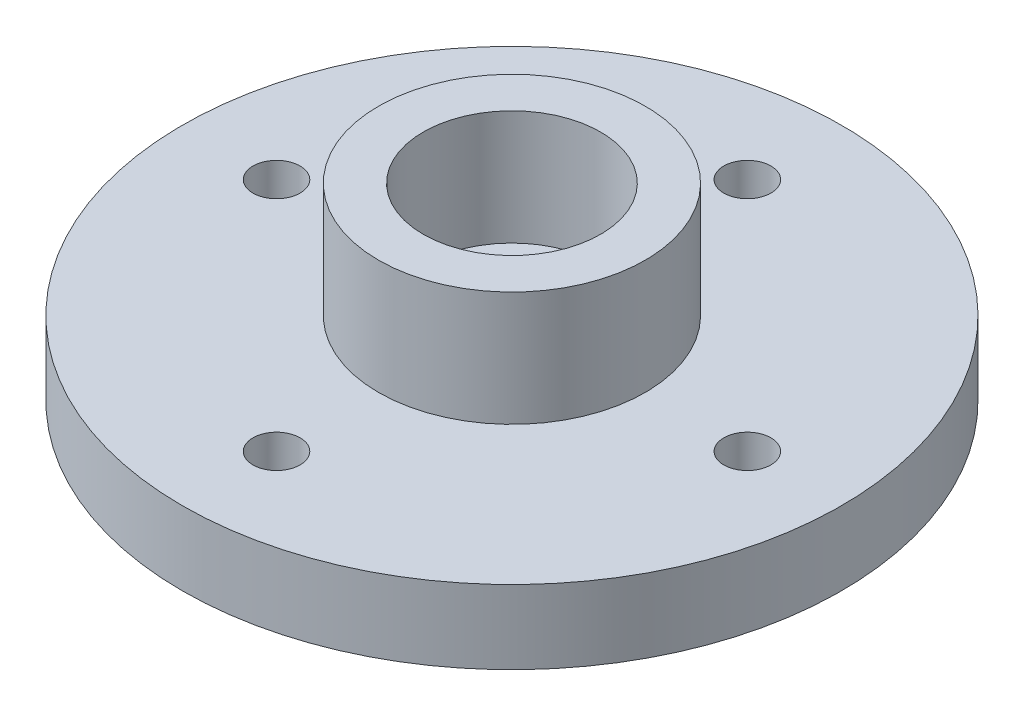
ISO-10303-21;
HEADER;
FILE_DESCRIPTION(('STEP AP214'),'2;1');
FILE_NAME('part.step','',(''),(''),'','','');
FILE_SCHEMA(('AUTOMOTIVE_DESIGN { 1 0 10303 214 1 1 1 1 }'));
ENDSEC;
DATA;
#1=APPLICATION_CONTEXT('core data for automotive mechanical design processes');
#2=APPLICATION_PROTOCOL_DEFINITION('international standard','automotive_design',2000,#1);
#3=PRODUCT_CONTEXT('',#1,'mechanical');
#4=PRODUCT('Part','Part','',(#3));
#5=PRODUCT_RELATED_PRODUCT_CATEGORY('part','',(#4));
#6=PRODUCT_DEFINITION_FORMATION('','',#4);
#7=PRODUCT_DEFINITION_CONTEXT('part definition',#1,'design');
#8=PRODUCT_DEFINITION('design','',#6,#7);
#9=PRODUCT_DEFINITION_SHAPE('','',#8);
#10=(LENGTH_UNIT() NAMED_UNIT(*) SI_UNIT(.MILLI.,.METRE.));
#11=(NAMED_UNIT(*) PLANE_ANGLE_UNIT() SI_UNIT($,.RADIAN.));
#12=(NAMED_UNIT(*) SI_UNIT($,.STERADIAN.) SOLID_ANGLE_UNIT());
#13=UNCERTAINTY_MEASURE_WITH_UNIT(LENGTH_MEASURE(1.E-05),#10,'distance_accuracy_value','');
#14=(GEOMETRIC_REPRESENTATION_CONTEXT(3) GLOBAL_UNCERTAINTY_ASSIGNED_CONTEXT((#13)) GLOBAL_UNIT_ASSIGNED_CONTEXT((#10,
#11,#12)) REPRESENTATION_CONTEXT('',''));
#15=CARTESIAN_POINT('',(0.,0.,0.));
#16=DIRECTION('',(0.,0.,1.));
#17=DIRECTION('',(1.,0.,0.));
#18=AXIS2_PLACEMENT_3D('',#15,#16,#17);
#19=CARTESIAN_POINT('',(0.,2.35,0.));
#20=DIRECTION('',(0.,1.,0.));
#21=DIRECTION('',(0.,0.,1.));
#22=AXIS2_PLACEMENT_3D('',#19,#20,#21);
#23=PLANE('',#22);
#24=CARTESIAN_POINT('',(0.,2.35,0.));
#25=DIRECTION('',(0.,1.,0.));
#26=DIRECTION('',(0.,0.,1.));
#27=AXIS2_PLACEMENT_3D('',#24,#25,#26);
#28=CIRCLE('',#27,1.5);
#29=CARTESIAN_POINT('',(0.,2.35,1.5));
#30=VERTEX_POINT('',#29);
#31=EDGE_CURVE('E53',#30,#30,#28,.T.);
#32=ORIENTED_EDGE('',*,*,#31,.F.);
#33=EDGE_LOOP('',(#32));
#34=FACE_BOUND('',#33,.T.);
#35=CARTESIAN_POINT('',(0.,2.35,0.));
#36=DIRECTION('',(0.,1.,0.));
#37=DIRECTION('',(0.,0.,1.));
#38=AXIS2_PLACEMENT_3D('',#35,#36,#37);
#39=CIRCLE('',#38,2.825);
#40=CARTESIAN_POINT('',(0.,2.35,2.825));
#41=VERTEX_POINT('',#40);
#42=EDGE_CURVE('E11',#41,#41,#39,.F.);
#43=ORIENTED_EDGE('',*,*,#42,.F.);
#44=EDGE_LOOP('',(#43));
#45=FACE_BOUND('',#44,.T.);
#46=ADVANCED_FACE('F45',(#34,#45),#23,.T.);
#47=CARTESIAN_POINT('',(0.,2.35,0.));
#48=DIRECTION('',(0.,-1.,0.));
#49=DIRECTION('',(0.,0.,-1.));
#50=AXIS2_PLACEMENT_3D('',#47,#48,#49);
#51=CYLINDRICAL_SURFACE('',#50,10.5);
#52=CARTESIAN_POINT('',(0.,2.35,0.));
#53=DIRECTION('',(0.,1.,0.));
#54=DIRECTION('',(0.,0.,1.));
#55=AXIS2_PLACEMENT_3D('',#52,#53,#54);
#56=CIRCLE('',#55,10.5);
#57=CARTESIAN_POINT('',(0.,2.35,10.5));
#58=VERTEX_POINT('',#57);
#59=EDGE_CURVE('E58',#58,#58,#56,.T.);
#60=ORIENTED_EDGE('',*,*,#59,.F.);
#61=EDGE_LOOP('',(#60));
#62=FACE_BOUND('',#61,.T.);
#63=CARTESIAN_POINT('',(0.,0.,0.));
#64=DIRECTION('',(0.,1.,0.));
#65=DIRECTION('',(0.,0.,1.));
#66=AXIS2_PLACEMENT_3D('',#63,#64,#65);
#67=CIRCLE('',#66,10.5);
#68=CARTESIAN_POINT('',(0.,0.,10.5));
#69=VERTEX_POINT('',#68);
#70=EDGE_CURVE('E85',#69,#69,#67,.T.);
#71=ORIENTED_EDGE('',*,*,#70,.T.);
#72=EDGE_LOOP('',(#71));
#73=FACE_BOUND('',#72,.T.);
#74=ADVANCED_FACE('F126',(#62,#73),#51,.T.);
#75=CARTESIAN_POINT('',(-7.5,2.35,0.));
#76=DIRECTION('',(0.,-1.,0.));
#77=DIRECTION('',(0.,0.,-1.));
#78=AXIS2_PLACEMENT_3D('',#75,#76,#77);
#79=CYLINDRICAL_SURFACE('',#78,0.75);
#80=CARTESIAN_POINT('',(-7.5,2.35,0.));
#81=DIRECTION('',(0.,1.,0.));
#82=DIRECTION('',(0.,0.,1.));
#83=AXIS2_PLACEMENT_3D('',#80,#81,#82);
#84=CIRCLE('',#83,0.75);
#85=CARTESIAN_POINT('',(-7.5,2.35,0.75));
#86=VERTEX_POINT('',#85);
#87=EDGE_CURVE('E64',#86,#86,#84,.T.);
#88=ORIENTED_EDGE('',*,*,#87,.T.);
#89=EDGE_LOOP('',(#88));
#90=FACE_BOUND('',#89,.T.);
#91=CARTESIAN_POINT('',(-7.5,0.,0.));
#92=DIRECTION('',(0.,1.,0.));
#93=DIRECTION('',(0.,0.,1.));
#94=AXIS2_PLACEMENT_3D('',#91,#92,#93);
#95=CIRCLE('',#94,0.75);
#96=CARTESIAN_POINT('',(-7.5,0.,0.75));
#97=VERTEX_POINT('',#96);
#98=EDGE_CURVE('E81',#97,#97,#95,.T.);
#99=ORIENTED_EDGE('',*,*,#98,.F.);
#100=EDGE_LOOP('',(#99));
#101=FACE_BOUND('',#100,.T.);
#102=ADVANCED_FACE('F114',(#90,#101),#79,.F.);
#103=CARTESIAN_POINT('',(0.,2.35,-7.5));
#104=DIRECTION('',(0.,-1.,0.));
#105=DIRECTION('',(0.,0.,-1.));
#106=AXIS2_PLACEMENT_3D('',#103,#104,#105);
#107=CYLINDRICAL_SURFACE('',#106,0.75);
#108=CARTESIAN_POINT('',(0.,2.35,-7.5));
#109=DIRECTION('',(0.,1.,0.));
#110=DIRECTION('',(0.,0.,1.));
#111=AXIS2_PLACEMENT_3D('',#108,#109,#110);
#112=CIRCLE('',#111,0.75);
#113=CARTESIAN_POINT('',(0.,2.35,-6.75));
#114=VERTEX_POINT('',#113);
#115=EDGE_CURVE('E102',#114,#114,#112,.T.);
#116=ORIENTED_EDGE('',*,*,#115,.T.);
#117=EDGE_LOOP('',(#116));
#118=FACE_BOUND('',#117,.T.);
#119=CARTESIAN_POINT('',(0.,0.,-7.5));
#120=DIRECTION('',(0.,1.,0.));
#121=DIRECTION('',(0.,0.,1.));
#122=AXIS2_PLACEMENT_3D('',#119,#120,#121);
#123=CIRCLE('',#122,0.75);
#124=CARTESIAN_POINT('',(0.,0.,-6.75));
#125=VERTEX_POINT('',#124);
#126=EDGE_CURVE('E77',#125,#125,#123,.T.);
#127=ORIENTED_EDGE('',*,*,#126,.F.);
#128=EDGE_LOOP('',(#127));
#129=FACE_BOUND('',#128,.T.);
#130=ADVANCED_FACE('F177',(#118,#129),#107,.F.);
#131=CARTESIAN_POINT('',(7.5,2.35,0.));
#132=DIRECTION('',(0.,-1.,0.));
#133=DIRECTION('',(0.,0.,-1.));
#134=AXIS2_PLACEMENT_3D('',#131,#132,#133);
#135=CYLINDRICAL_SURFACE('',#134,0.75);
#136=CARTESIAN_POINT('',(7.5,2.35,0.));
#137=DIRECTION('',(0.,1.,0.));
#138=DIRECTION('',(0.,0.,1.));
#139=AXIS2_PLACEMENT_3D('',#136,#137,#138);
#140=CIRCLE('',#139,0.75);
#141=CARTESIAN_POINT('',(7.5,2.35,0.749999999999999));
#142=VERTEX_POINT('',#141);
#143=EDGE_CURVE('E96',#142,#142,#140,.T.);
#144=ORIENTED_EDGE('',*,*,#143,.T.);
#145=EDGE_LOOP('',(#144));
#146=FACE_BOUND('',#145,.T.);
#147=CARTESIAN_POINT('',(7.5,0.,0.));
#148=DIRECTION('',(0.,1.,0.));
#149=DIRECTION('',(0.,0.,1.));
#150=AXIS2_PLACEMENT_3D('',#147,#148,#149);
#151=CIRCLE('',#150,0.75);
#152=CARTESIAN_POINT('',(7.5,0.,0.749999999999999));
#153=VERTEX_POINT('',#152);
#154=EDGE_CURVE('E72',#153,#153,#151,.T.);
#155=ORIENTED_EDGE('',*,*,#154,.F.);
#156=EDGE_LOOP('',(#155));
#157=FACE_BOUND('',#156,.T.);
#158=ADVANCED_FACE('F180',(#146,#157),#135,.F.);
#159=CARTESIAN_POINT('',(0.,2.35,7.5));
#160=DIRECTION('',(0.,-1.,0.));
#161=DIRECTION('',(0.,0.,-1.));
#162=AXIS2_PLACEMENT_3D('',#159,#160,#161);
#163=CYLINDRICAL_SURFACE('',#162,0.750000000000001);
#164=CARTESIAN_POINT('',(0.,2.35,7.5));
#165=DIRECTION('',(0.,1.,0.));
#166=DIRECTION('',(0.,0.,1.));
#167=AXIS2_PLACEMENT_3D('',#164,#165,#166);
#168=CIRCLE('',#167,0.750000000000001);
#169=CARTESIAN_POINT('',(0.,2.35,8.25));
#170=VERTEX_POINT('',#169);
#171=EDGE_CURVE('E91',#170,#170,#168,.T.);
#172=ORIENTED_EDGE('',*,*,#171,.T.);
#173=EDGE_LOOP('',(#172));
#174=FACE_BOUND('',#173,.T.);
#175=CARTESIAN_POINT('',(0.,0.,7.5));
#176=DIRECTION('',(0.,1.,0.));
#177=DIRECTION('',(0.,0.,1.));
#178=AXIS2_PLACEMENT_3D('',#175,#176,#177);
#179=CIRCLE('',#178,0.750000000000001);
#180=CARTESIAN_POINT('',(0.,0.,8.25));
#181=VERTEX_POINT('',#180);
#182=EDGE_CURVE('E68',#181,#181,#179,.T.);
#183=ORIENTED_EDGE('',*,*,#182,.F.);
#184=EDGE_LOOP('',(#183));
#185=FACE_BOUND('',#184,.T.);
#186=ADVANCED_FACE('F47',(#174,#185),#163,.F.);
#187=CARTESIAN_POINT('',(0.,2.35,0.));
#188=DIRECTION('',(0.,-1.,0.));
#189=DIRECTION('',(0.,0.,-1.));
#190=AXIS2_PLACEMENT_3D('',#187,#188,#189);
#191=CYLINDRICAL_SURFACE('',#190,1.5);
#192=ORIENTED_EDGE('',*,*,#31,.T.);
#193=EDGE_LOOP('',(#192));
#194=FACE_BOUND('',#193,.T.);
#195=CARTESIAN_POINT('',(0.,0.,0.));
#196=DIRECTION('',(0.,1.,0.));
#197=DIRECTION('',(0.,0.,1.));
#198=AXIS2_PLACEMENT_3D('',#195,#196,#197);
#199=CIRCLE('',#198,1.5);
#200=CARTESIAN_POINT('',(0.,0.,1.5));
#201=VERTEX_POINT('',#200);
#202=EDGE_CURVE('E88',#201,#201,#199,.T.);
#203=ORIENTED_EDGE('',*,*,#202,.F.);
#204=EDGE_LOOP('',(#203));
#205=FACE_BOUND('',#204,.T.);
#206=ADVANCED_FACE('F121',(#194,#205),#191,.F.);
#207=CARTESIAN_POINT('',(0.,2.35,0.));
#208=DIRECTION('',(0.,1.,0.));
#209=DIRECTION('',(0.,0.,1.));
#210=AXIS2_PLACEMENT_3D('',#207,#208,#209);
#211=CIRCLE('',#210,4.25);
#212=CARTESIAN_POINT('',(0.,2.35,4.25));
#213=VERTEX_POINT('',#212);
#214=EDGE_CURVE('E105',#213,#213,#211,.T.);
#215=ORIENTED_EDGE('',*,*,#214,.F.);
#216=EDGE_LOOP('',(#215));
#217=FACE_BOUND('',#216,.T.);
#218=ORIENTED_EDGE('',*,*,#171,.F.);
#219=EDGE_LOOP('',(#218));
#220=FACE_BOUND('',#219,.T.);
#221=ORIENTED_EDGE('',*,*,#143,.F.);
#222=EDGE_LOOP('',(#221));
#223=FACE_BOUND('',#222,.T.);
#224=ORIENTED_EDGE('',*,*,#115,.F.);
#225=EDGE_LOOP('',(#224));
#226=FACE_BOUND('',#225,.T.);
#227=ORIENTED_EDGE('',*,*,#87,.F.);
#228=EDGE_LOOP('',(#227));
#229=FACE_BOUND('',#228,.T.);
#230=ORIENTED_EDGE('',*,*,#59,.T.);
#231=EDGE_LOOP('',(#230));
#232=FACE_BOUND('',#231,.T.);
#233=ADVANCED_FACE('F117',(#217,#220,#223,#226,#229,#232),#23,.T.);
#234=CARTESIAN_POINT('',(0.,0.,0.));
#235=DIRECTION('',(0.,1.,0.));
#236=DIRECTION('',(0.,0.,1.));
#237=AXIS2_PLACEMENT_3D('',#234,#235,#236);
#238=PLANE('',#237);
#239=ORIENTED_EDGE('',*,*,#182,.T.);
#240=EDGE_LOOP('',(#239));
#241=FACE_BOUND('',#240,.T.);
#242=ORIENTED_EDGE('',*,*,#154,.T.);
#243=EDGE_LOOP('',(#242));
#244=FACE_BOUND('',#243,.T.);
#245=ORIENTED_EDGE('',*,*,#126,.T.);
#246=EDGE_LOOP('',(#245));
#247=FACE_BOUND('',#246,.T.);
#248=ORIENTED_EDGE('',*,*,#98,.T.);
#249=EDGE_LOOP('',(#248));
#250=FACE_BOUND('',#249,.T.);
#251=ORIENTED_EDGE('',*,*,#70,.F.);
#252=EDGE_LOOP('',(#251));
#253=FACE_BOUND('',#252,.T.);
#254=ORIENTED_EDGE('',*,*,#202,.T.);
#255=EDGE_LOOP('',(#254));
#256=FACE_BOUND('',#255,.T.);
#257=ADVANCED_FACE('F120',(#241,#244,#247,#250,#253,#256),#238,.F.);
#258=CARTESIAN_POINT('',(0.,6.,0.));
#259=DIRECTION('',(0.,1.,0.));
#260=DIRECTION('',(0.,0.,1.));
#261=AXIS2_PLACEMENT_3D('',#258,#259,#260);
#262=PLANE('',#261);
#263=CARTESIAN_POINT('',(0.,6.,0.));
#264=DIRECTION('',(0.,1.,0.));
#265=DIRECTION('',(0.,0.,1.));
#266=AXIS2_PLACEMENT_3D('',#263,#264,#265);
#267=CIRCLE('',#266,4.25);
#268=CARTESIAN_POINT('',(0.,6.,4.25));
#269=VERTEX_POINT('',#268);
#270=EDGE_CURVE('E73',#269,#269,#267,.T.);
#271=ORIENTED_EDGE('',*,*,#270,.T.);
#272=EDGE_LOOP('',(#271));
#273=FACE_BOUND('',#272,.T.);
#274=CARTESIAN_POINT('',(0.,6.,0.));
#275=DIRECTION('',(0.,1.,0.));
#276=DIRECTION('',(0.,0.,1.));
#277=AXIS2_PLACEMENT_3D('',#274,#275,#276);
#278=CIRCLE('',#277,2.825);
#279=CARTESIAN_POINT('',(0.,6.,2.825));
#280=VERTEX_POINT('',#279);
#281=EDGE_CURVE('E160',#280,#280,#278,.T.);
#282=ORIENTED_EDGE('',*,*,#281,.F.);
#283=EDGE_LOOP('',(#282));
#284=FACE_BOUND('',#283,.T.);
#285=ADVANCED_FACE('F133',(#273,#284),#262,.T.);
#286=CARTESIAN_POINT('',(0.,6.,0.));
#287=DIRECTION('',(0.,-1.,0.));
#288=DIRECTION('',(0.,0.,-1.));
#289=AXIS2_PLACEMENT_3D('',#286,#287,#288);
#290=CYLINDRICAL_SURFACE('',#289,4.25);
#291=ORIENTED_EDGE('',*,*,#270,.F.);
#292=EDGE_LOOP('',(#291));
#293=FACE_BOUND('',#292,.T.);
#294=ORIENTED_EDGE('',*,*,#214,.T.);
#295=EDGE_LOOP('',(#294));
#296=FACE_BOUND('',#295,.T.);
#297=ADVANCED_FACE('F139',(#293,#296),#290,.T.);
#298=CARTESIAN_POINT('',(0.,6.,0.));
#299=DIRECTION('',(0.,-1.,0.));
#300=DIRECTION('',(0.,0.,-1.));
#301=AXIS2_PLACEMENT_3D('',#298,#299,#300);
#302=CYLINDRICAL_SURFACE('',#301,2.825);
#303=ORIENTED_EDGE('',*,*,#281,.T.);
#304=EDGE_LOOP('',(#303));
#305=FACE_BOUND('',#304,.T.);
#306=ORIENTED_EDGE('',*,*,#42,.T.);
#307=EDGE_LOOP('',(#306));
#308=FACE_BOUND('',#307,.T.);
#309=ADVANCED_FACE('F151',(#305,#308),#302,.F.);
#310=CLOSED_SHELL('',(#46,#74,#102,#130,#158,#186,#206,#233,#257,#285,#297,#309));
#311=MANIFOLD_SOLID_BREP('B2',#310);
#312=ADVANCED_BREP_SHAPE_REPRESENTATION('',(#18,#311),#14);
#313=SHAPE_DEFINITION_REPRESENTATION(#9,#312);
ENDSEC;
END-ISO-10303-21;
